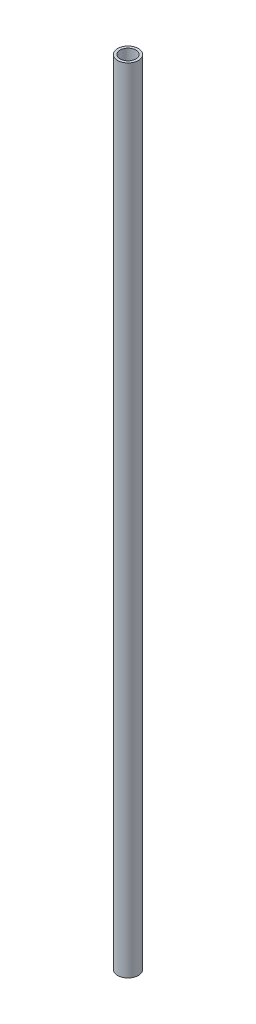
ISO-10303-21;
HEADER;
FILE_DESCRIPTION(('STEP AP214'),'2;1');
FILE_NAME('part.step','',(''),(''),'','','');
FILE_SCHEMA(('AUTOMOTIVE_DESIGN { 1 0 10303 214 1 1 1 1 }'));
ENDSEC;
DATA;
#1=APPLICATION_CONTEXT('core data for automotive mechanical design processes');
#2=APPLICATION_PROTOCOL_DEFINITION('international standard','automotive_design',2000,#1);
#3=PRODUCT_CONTEXT('',#1,'mechanical');
#4=PRODUCT('Part','Part','',(#3));
#5=PRODUCT_RELATED_PRODUCT_CATEGORY('part','',(#4));
#6=PRODUCT_DEFINITION_FORMATION('','',#4);
#7=PRODUCT_DEFINITION_CONTEXT('part definition',#1,'design');
#8=PRODUCT_DEFINITION('design','',#6,#7);
#9=PRODUCT_DEFINITION_SHAPE('','',#8);
#10=(LENGTH_UNIT() NAMED_UNIT(*) SI_UNIT(.MILLI.,.METRE.));
#11=(NAMED_UNIT(*) PLANE_ANGLE_UNIT() SI_UNIT($,.RADIAN.));
#12=(NAMED_UNIT(*) SI_UNIT($,.STERADIAN.) SOLID_ANGLE_UNIT());
#13=UNCERTAINTY_MEASURE_WITH_UNIT(LENGTH_MEASURE(1.E-05),#10,'distance_accuracy_value','');
#14=(GEOMETRIC_REPRESENTATION_CONTEXT(3) GLOBAL_UNCERTAINTY_ASSIGNED_CONTEXT((#13)) GLOBAL_UNIT_ASSIGNED_CONTEXT((#10,
#11,#12)) REPRESENTATION_CONTEXT('',''));
#15=CARTESIAN_POINT('',(0.,0.,0.));
#16=DIRECTION('',(0.,0.,1.));
#17=DIRECTION('',(1.,0.,0.));
#18=AXIS2_PLACEMENT_3D('',#15,#16,#17);
#19=CARTESIAN_POINT('',(0.,484.1875,0.));
#20=DIRECTION('',(0.,1.,0.));
#21=DIRECTION('',(0.,0.,1.));
#22=AXIS2_PLACEMENT_3D('',#19,#20,#21);
#23=PLANE('',#22);
#24=CARTESIAN_POINT('',(0.,484.1875,0.));
#25=DIRECTION('',(0.,1.,0.));
#26=DIRECTION('',(0.,0.,1.));
#27=AXIS2_PLACEMENT_3D('',#24,#25,#26);
#28=CIRCLE('',#27,12.7);
#29=CARTESIAN_POINT('',(0.,484.1875,12.7));
#30=VERTEX_POINT('',#29);
#31=EDGE_CURVE('E10',#30,#30,#28,.T.);
#32=ORIENTED_EDGE('',*,*,#31,.T.);
#33=EDGE_LOOP('',(#32));
#34=FACE_BOUND('',#33,.T.);
#35=CARTESIAN_POINT('',(0.,484.1875,0.));
#36=DIRECTION('',(0.,1.,0.));
#37=DIRECTION('',(0.,0.,1.));
#38=AXIS2_PLACEMENT_3D('',#35,#36,#37);
#39=CIRCLE('',#38,9.52500000000001);
#40=CARTESIAN_POINT('',(0.,484.1875,9.52500000000001));
#41=VERTEX_POINT('',#40);
#42=EDGE_CURVE('E48',#41,#41,#39,.T.);
#43=ORIENTED_EDGE('',*,*,#42,.F.);
#44=EDGE_LOOP('',(#43));
#45=FACE_BOUND('',#44,.T.);
#46=ADVANCED_FACE('F37',(#34,#45),#23,.T.);
#47=CARTESIAN_POINT('',(0.,-484.1875,0.));
#48=DIRECTION('',(0.,1.,0.));
#49=DIRECTION('',(0.,0.,1.));
#50=AXIS2_PLACEMENT_3D('',#47,#48,#49);
#51=PLANE('',#50);
#52=CARTESIAN_POINT('',(0.,-484.1875,0.));
#53=DIRECTION('',(0.,1.,0.));
#54=DIRECTION('',(0.,0.,1.));
#55=AXIS2_PLACEMENT_3D('',#52,#53,#54);
#56=CIRCLE('',#55,12.7);
#57=CARTESIAN_POINT('',(0.,-484.1875,12.7));
#58=VERTEX_POINT('',#57);
#59=EDGE_CURVE('E41',#58,#58,#56,.T.);
#60=ORIENTED_EDGE('',*,*,#59,.F.);
#61=EDGE_LOOP('',(#60));
#62=FACE_BOUND('',#61,.T.);
#63=CARTESIAN_POINT('',(0.,-484.1875,0.));
#64=DIRECTION('',(0.,1.,0.));
#65=DIRECTION('',(0.,0.,1.));
#66=AXIS2_PLACEMENT_3D('',#63,#64,#65);
#67=CIRCLE('',#66,9.52500000000001);
#68=CARTESIAN_POINT('',(0.,-484.1875,9.52500000000001));
#69=VERTEX_POINT('',#68);
#70=EDGE_CURVE('E50',#69,#69,#67,.T.);
#71=ORIENTED_EDGE('',*,*,#70,.T.);
#72=EDGE_LOOP('',(#71));
#73=FACE_BOUND('',#72,.T.);
#74=ADVANCED_FACE('F60',(#62,#73),#51,.F.);
#75=CARTESIAN_POINT('',(0.,484.1875,0.));
#76=DIRECTION('',(0.,-1.,0.));
#77=DIRECTION('',(0.,0.,-1.));
#78=AXIS2_PLACEMENT_3D('',#75,#76,#77);
#79=CYLINDRICAL_SURFACE('',#78,12.7);
#80=ORIENTED_EDGE('',*,*,#31,.F.);
#81=EDGE_LOOP('',(#80));
#82=FACE_BOUND('',#81,.T.);
#83=ORIENTED_EDGE('',*,*,#59,.T.);
#84=EDGE_LOOP('',(#83));
#85=FACE_BOUND('',#84,.T.);
#86=ADVANCED_FACE('F39',(#82,#85),#79,.T.);
#87=CARTESIAN_POINT('',(0.,484.1875,0.));
#88=DIRECTION('',(0.,-1.,0.));
#89=DIRECTION('',(0.,0.,-1.));
#90=AXIS2_PLACEMENT_3D('',#87,#88,#89);
#91=CYLINDRICAL_SURFACE('',#90,9.52500000000001);
#92=ORIENTED_EDGE('',*,*,#42,.T.);
#93=EDGE_LOOP('',(#92));
#94=FACE_BOUND('',#93,.T.);
#95=ORIENTED_EDGE('',*,*,#70,.F.);
#96=EDGE_LOOP('',(#95));
#97=FACE_BOUND('',#96,.T.);
#98=ADVANCED_FACE('F56',(#94,#97),#91,.F.);
#99=CLOSED_SHELL('',(#46,#74,#86,#98));
#100=MANIFOLD_SOLID_BREP('B2',#99);
#101=ADVANCED_BREP_SHAPE_REPRESENTATION('',(#18,#100),#14);
#102=SHAPE_DEFINITION_REPRESENTATION(#9,#101);
ENDSEC;
END-ISO-10303-21;
